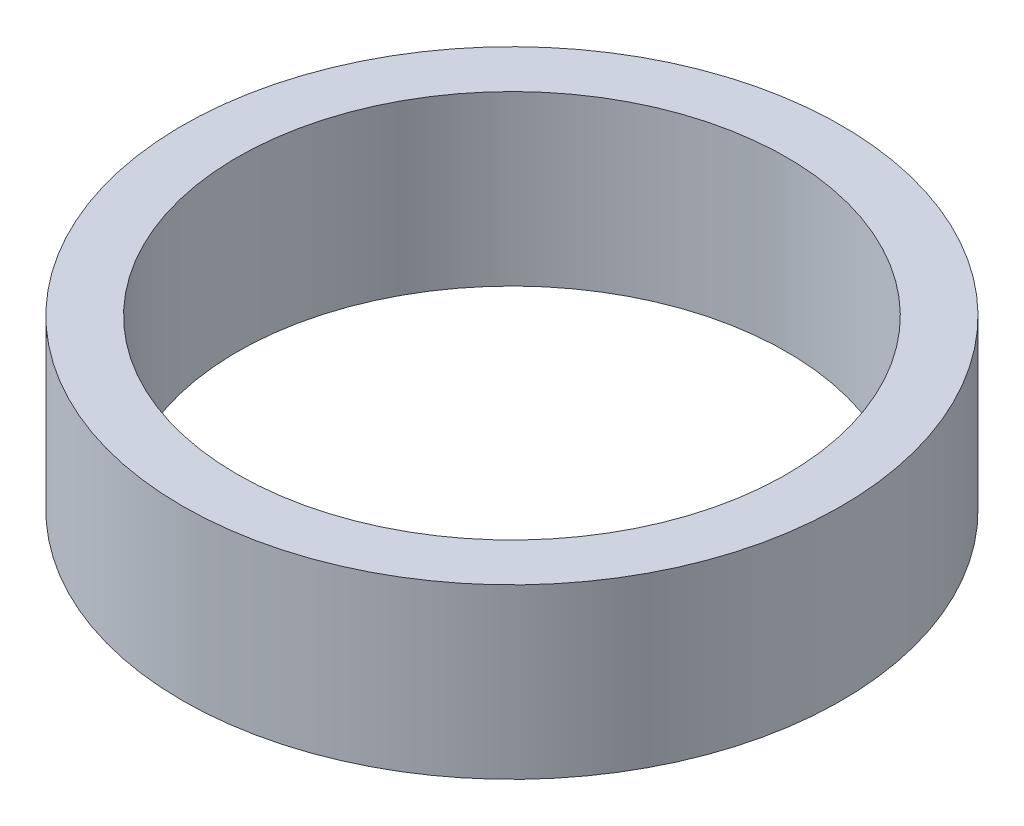
ISO-10303-21;
HEADER;
FILE_DESCRIPTION(('STEP AP214'),'2;1');
FILE_NAME('part.step','',(''),(''),'','','');
FILE_SCHEMA(('AUTOMOTIVE_DESIGN { 1 0 10303 214 1 1 1 1 }'));
ENDSEC;
DATA;
#1=APPLICATION_CONTEXT('core data for automotive mechanical design processes');
#2=APPLICATION_PROTOCOL_DEFINITION('international standard','automotive_design',2000,#1);
#3=PRODUCT_CONTEXT('',#1,'mechanical');
#4=PRODUCT('Part','Part','',(#3));
#5=PRODUCT_RELATED_PRODUCT_CATEGORY('part','',(#4));
#6=PRODUCT_DEFINITION_FORMATION('','',#4);
#7=PRODUCT_DEFINITION_CONTEXT('part definition',#1,'design');
#8=PRODUCT_DEFINITION('design','',#6,#7);
#9=PRODUCT_DEFINITION_SHAPE('','',#8);
#10=(LENGTH_UNIT() NAMED_UNIT(*) SI_UNIT(.MILLI.,.METRE.));
#11=(NAMED_UNIT(*) PLANE_ANGLE_UNIT() SI_UNIT($,.RADIAN.));
#12=(NAMED_UNIT(*) SI_UNIT($,.STERADIAN.) SOLID_ANGLE_UNIT());
#13=UNCERTAINTY_MEASURE_WITH_UNIT(LENGTH_MEASURE(1.E-05),#10,'distance_accuracy_value','');
#14=(GEOMETRIC_REPRESENTATION_CONTEXT(3) GLOBAL_UNCERTAINTY_ASSIGNED_CONTEXT((#13)) GLOBAL_UNIT_ASSIGNED_CONTEXT((#10,
#11,#12)) REPRESENTATION_CONTEXT('',''));
#15=CARTESIAN_POINT('',(0.,0.,0.));
#16=DIRECTION('',(0.,0.,1.));
#17=DIRECTION('',(1.,0.,0.));
#18=AXIS2_PLACEMENT_3D('',#15,#16,#17);
#19=CARTESIAN_POINT('',(0.,23.,0.));
#20=DIRECTION('',(0.,-1.,0.));
#21=DIRECTION('',(0.,0.,-1.));
#22=AXIS2_PLACEMENT_3D('',#19,#20,#21);
#23=CYLINDRICAL_SURFACE('',#22,45.);
#24=CARTESIAN_POINT('',(0.,23.,0.));
#25=DIRECTION('',(0.,1.,0.));
#26=DIRECTION('',(0.,0.,1.));
#27=AXIS2_PLACEMENT_3D('',#24,#25,#26);
#28=CIRCLE('',#27,45.);
#29=CARTESIAN_POINT('',(0.,23.,45.));
#30=VERTEX_POINT('',#29);
#31=EDGE_CURVE('E10',#30,#30,#28,.T.);
#32=ORIENTED_EDGE('',*,*,#31,.F.);
#33=EDGE_LOOP('',(#32));
#34=FACE_BOUND('',#33,.T.);
#35=CARTESIAN_POINT('',(0.,0.,0.));
#36=DIRECTION('',(0.,1.,0.));
#37=DIRECTION('',(0.,0.,1.));
#38=AXIS2_PLACEMENT_3D('',#35,#36,#37);
#39=CIRCLE('',#38,45.);
#40=CARTESIAN_POINT('',(0.,0.,45.));
#41=VERTEX_POINT('',#40);
#42=EDGE_CURVE('E37',#41,#41,#39,.T.);
#43=ORIENTED_EDGE('',*,*,#42,.T.);
#44=EDGE_LOOP('',(#43));
#45=FACE_BOUND('',#44,.T.);
#46=ADVANCED_FACE('F40',(#34,#45),#23,.T.);
#47=CARTESIAN_POINT('',(0.,23.,0.));
#48=DIRECTION('',(0.,1.,0.));
#49=DIRECTION('',(0.,0.,1.));
#50=AXIS2_PLACEMENT_3D('',#47,#48,#49);
#51=PLANE('',#50);
#52=CARTESIAN_POINT('',(0.,23.,0.));
#53=DIRECTION('',(0.,1.,0.));
#54=DIRECTION('',(0.,0.,1.));
#55=AXIS2_PLACEMENT_3D('',#52,#53,#54);
#56=CIRCLE('',#55,37.5);
#57=CARTESIAN_POINT('',(0.,23.,37.5));
#58=VERTEX_POINT('',#57);
#59=EDGE_CURVE('E50',#58,#58,#56,.T.);
#60=ORIENTED_EDGE('',*,*,#59,.F.);
#61=EDGE_LOOP('',(#60));
#62=FACE_BOUND('',#61,.T.);
#63=ORIENTED_EDGE('',*,*,#31,.T.);
#64=EDGE_LOOP('',(#63));
#65=FACE_BOUND('',#64,.T.);
#66=ADVANCED_FACE('F59',(#62,#65),#51,.T.);
#67=CARTESIAN_POINT('',(0.,0.,0.));
#68=DIRECTION('',(0.,1.,0.));
#69=DIRECTION('',(0.,0.,1.));
#70=AXIS2_PLACEMENT_3D('',#67,#68,#69);
#71=PLANE('',#70);
#72=CARTESIAN_POINT('',(0.,0.,0.));
#73=DIRECTION('',(0.,1.,0.));
#74=DIRECTION('',(0.,0.,1.));
#75=AXIS2_PLACEMENT_3D('',#72,#73,#74);
#76=CIRCLE('',#75,37.5);
#77=CARTESIAN_POINT('',(0.,0.,37.5));
#78=VERTEX_POINT('',#77);
#79=EDGE_CURVE('E47',#78,#78,#76,.T.);
#80=ORIENTED_EDGE('',*,*,#79,.T.);
#81=EDGE_LOOP('',(#80));
#82=FACE_BOUND('',#81,.T.);
#83=ORIENTED_EDGE('',*,*,#42,.F.);
#84=EDGE_LOOP('',(#83));
#85=FACE_BOUND('',#84,.T.);
#86=ADVANCED_FACE('F58',(#82,#85),#71,.F.);
#87=CARTESIAN_POINT('',(0.,23.,0.));
#88=DIRECTION('',(0.,-1.,0.));
#89=DIRECTION('',(0.,0.,-1.));
#90=AXIS2_PLACEMENT_3D('',#87,#88,#89);
#91=CYLINDRICAL_SURFACE('',#90,37.5);
#92=ORIENTED_EDGE('',*,*,#59,.T.);
#93=EDGE_LOOP('',(#92));
#94=FACE_BOUND('',#93,.T.);
#95=ORIENTED_EDGE('',*,*,#79,.F.);
#96=EDGE_LOOP('',(#95));
#97=FACE_BOUND('',#96,.T.);
#98=ADVANCED_FACE('F54',(#94,#97),#91,.F.);
#99=CLOSED_SHELL('',(#46,#66,#86,#98));
#100=MANIFOLD_SOLID_BREP('B2',#99);
#101=ADVANCED_BREP_SHAPE_REPRESENTATION('',(#18,#100),#14);
#102=SHAPE_DEFINITION_REPRESENTATION(#9,#101);
ENDSEC;
END-ISO-10303-21;
